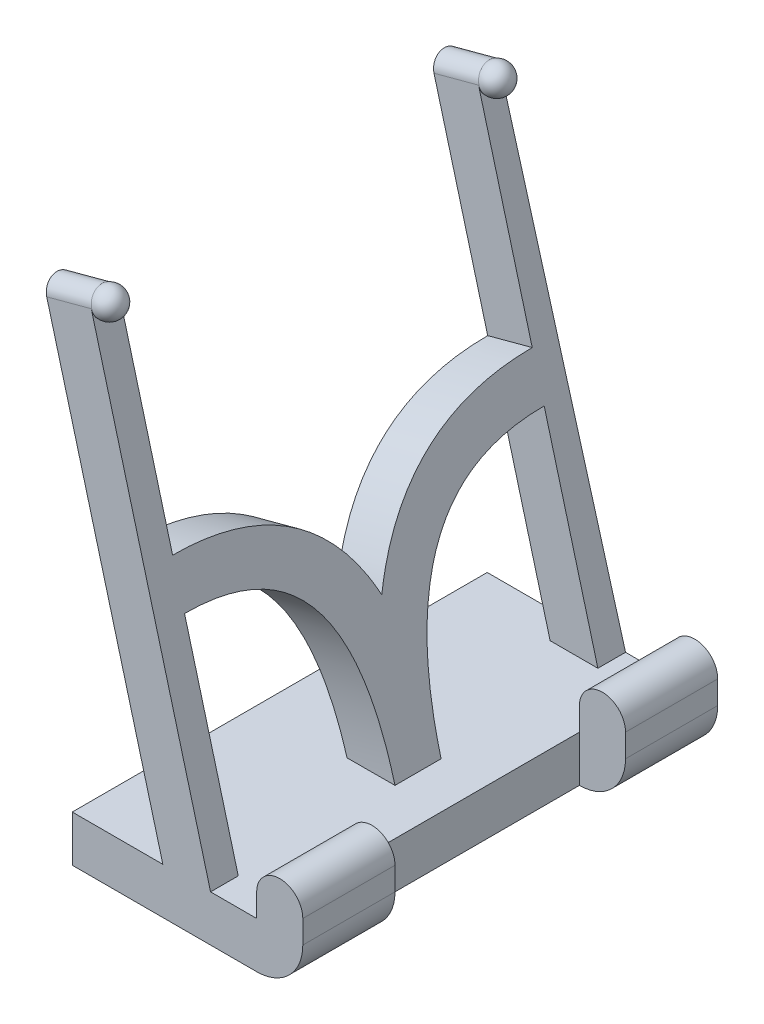
ISO-10303-21;
HEADER;
FILE_DESCRIPTION(('STEP AP214'),'2;1');
FILE_NAME('part.step','',(''),(''),'','','');
FILE_SCHEMA(('AUTOMOTIVE_DESIGN { 1 0 10303 214 1 1 1 1 }'));
ENDSEC;
DATA;
#1=APPLICATION_CONTEXT('core data for automotive mechanical design processes');
#2=APPLICATION_PROTOCOL_DEFINITION('international standard','automotive_design',2000,#1);
#3=PRODUCT_CONTEXT('',#1,'mechanical');
#4=PRODUCT('Part','Part','',(#3));
#5=PRODUCT_RELATED_PRODUCT_CATEGORY('part','',(#4));
#6=PRODUCT_DEFINITION_FORMATION('','',#4);
#7=PRODUCT_DEFINITION_CONTEXT('part definition',#1,'design');
#8=PRODUCT_DEFINITION('design','',#6,#7);
#9=PRODUCT_DEFINITION_SHAPE('','',#8);
#10=(LENGTH_UNIT() NAMED_UNIT(*) SI_UNIT(.MILLI.,.METRE.));
#11=(NAMED_UNIT(*) PLANE_ANGLE_UNIT() SI_UNIT($,.RADIAN.));
#12=(NAMED_UNIT(*) SI_UNIT($,.STERADIAN.) SOLID_ANGLE_UNIT());
#13=UNCERTAINTY_MEASURE_WITH_UNIT(LENGTH_MEASURE(1.E-05),#10,'distance_accuracy_value','');
#14=(GEOMETRIC_REPRESENTATION_CONTEXT(3) GLOBAL_UNCERTAINTY_ASSIGNED_CONTEXT((#13)) GLOBAL_UNIT_ASSIGNED_CONTEXT((#10,
#11,#12)) REPRESENTATION_CONTEXT('',''));
#15=CARTESIAN_POINT('',(0.,0.,0.));
#16=DIRECTION('',(0.,0.,1.));
#17=DIRECTION('',(1.,0.,0.));
#18=AXIS2_PLACEMENT_3D('',#15,#16,#17);
#19=CARTESIAN_POINT('',(-10.,10.,0.));
#20=DIRECTION('',(0.,0.,1.));
#21=DIRECTION('',(1.,0.,0.));
#22=AXIS2_PLACEMENT_3D('',#19,#20,#21);
#23=CYLINDRICAL_SURFACE('',#22,10.);
#24=DIRECTION('',(0.,0.,-1.));
#25=VECTOR('',#24,1.);
#26=CARTESIAN_POINT('',(0.,10.,0.));
#27=LINE('',#26,#25);
#28=CARTESIAN_POINT('',(0.,10.,-25.));
#29=VERTEX_POINT('',#28);
#30=CARTESIAN_POINT('',(0.,10.,-45.));
#31=VERTEX_POINT('',#30);
#32=EDGE_CURVE('E744',#29,#31,#27,.T.);
#33=ORIENTED_EDGE('',*,*,#32,.F.);
#34=CARTESIAN_POINT('',(-10.,10.,-25.));
#35=DIRECTION('',(0.,0.,-1.));
#36=DIRECTION('',(-1.,0.,0.));
#37=AXIS2_PLACEMENT_3D('',#34,#35,#36);
#38=CIRCLE('',#37,10.);
#39=CARTESIAN_POINT('',(-10.,0.,-25.));
#40=VERTEX_POINT('',#39);
#41=EDGE_CURVE('E156',#40,#29,#38,.F.);
#42=ORIENTED_EDGE('',*,*,#41,.F.);
#43=DIRECTION('',(0.,0.,-1.));
#44=VECTOR('',#43,1.);
#45=CARTESIAN_POINT('',(-10.,0.,0.));
#46=LINE('',#45,#44);
#47=CARTESIAN_POINT('',(-10.,0.,-45.));
#48=VERTEX_POINT('',#47);
#49=EDGE_CURVE('E748',#48,#40,#46,.F.);
#50=ORIENTED_EDGE('',*,*,#49,.F.);
#51=CARTESIAN_POINT('',(-10.,10.,-45.));
#52=DIRECTION('',(0.,0.,-1.));
#53=DIRECTION('',(-1.,0.,0.));
#54=AXIS2_PLACEMENT_3D('',#51,#52,#53);
#55=CIRCLE('',#54,10.);
#56=EDGE_CURVE('E12',#31,#48,#55,.T.);
#57=ORIENTED_EDGE('',*,*,#56,.F.);
#58=EDGE_LOOP('',(#33,#42,#50,#57));
#59=FACE_BOUND('',#58,.T.);
#60=ADVANCED_FACE('F148',(#59),#23,.T.);
#61=CARTESIAN_POINT('',(-10.,10.,0.));
#62=DIRECTION('',(0.,0.,1.));
#63=DIRECTION('',(1.,0.,0.));
#64=AXIS2_PLACEMENT_3D('',#61,#62,#63);
#65=CYLINDRICAL_SURFACE('',#64,10.);
#66=DIRECTION('',(0.,0.,-1.));
#67=VECTOR('',#66,1.);
#68=CARTESIAN_POINT('',(0.,10.,0.));
#69=LINE('',#68,#67);
#70=CARTESIAN_POINT('',(0.,10.,45.));
#71=VERTEX_POINT('',#70);
#72=CARTESIAN_POINT('',(0.,10.,25.));
#73=VERTEX_POINT('',#72);
#74=EDGE_CURVE('E730',#71,#73,#69,.T.);
#75=ORIENTED_EDGE('',*,*,#74,.F.);
#76=CARTESIAN_POINT('',(-9.99999999999999,10.,45.));
#77=DIRECTION('',(0.,0.,-1.));
#78=DIRECTION('',(-1.,0.,0.));
#79=AXIS2_PLACEMENT_3D('',#76,#77,#78);
#80=CIRCLE('',#79,10.);
#81=CARTESIAN_POINT('',(-9.99999999999999,0.,45.));
#82=VERTEX_POINT('',#81);
#83=EDGE_CURVE('E738',#82,#71,#80,.F.);
#84=ORIENTED_EDGE('',*,*,#83,.F.);
#85=DIRECTION('',(0.,0.,-1.));
#86=VECTOR('',#85,1.);
#87=CARTESIAN_POINT('',(-10.,0.,0.));
#88=LINE('',#87,#86);
#89=CARTESIAN_POINT('',(-9.99999999999999,0.,25.));
#90=VERTEX_POINT('',#89);
#91=EDGE_CURVE('E734',#90,#82,#88,.F.);
#92=ORIENTED_EDGE('',*,*,#91,.F.);
#93=CARTESIAN_POINT('',(-9.99999999999999,10.,25.));
#94=DIRECTION('',(0.,0.,-1.));
#95=DIRECTION('',(-1.,0.,0.));
#96=AXIS2_PLACEMENT_3D('',#93,#94,#95);
#97=CIRCLE('',#96,10.);
#98=EDGE_CURVE('E741',#73,#90,#97,.T.);
#99=ORIENTED_EDGE('',*,*,#98,.F.);
#100=EDGE_LOOP('',(#75,#84,#92,#99));
#101=FACE_BOUND('',#100,.T.);
#102=ADVANCED_FACE('F815',(#101),#65,.T.);
#103=CARTESIAN_POINT('',(-4.99999999999999,15.,25.));
#104=DIRECTION('',(0.,0.,1.));
#105=DIRECTION('',(1.,0.,0.));
#106=AXIS2_PLACEMENT_3D('',#103,#104,#105);
#107=CYLINDRICAL_SURFACE('',#106,5.);
#108=DIRECTION('',(0.,0.,1.));
#109=VECTOR('',#108,1.);
#110=CARTESIAN_POINT('',(0.,15.,0.));
#111=LINE('',#110,#109);
#112=CARTESIAN_POINT('',(0.,15.,25.));
#113=VERTEX_POINT('',#112);
#114=CARTESIAN_POINT('',(0.,15.,45.));
#115=VERTEX_POINT('',#114);
#116=EDGE_CURVE('E716',#113,#115,#111,.T.);
#117=ORIENTED_EDGE('',*,*,#116,.F.);
#118=CARTESIAN_POINT('',(-4.99999999999999,15.,25.));
#119=DIRECTION('',(0.,0.,-1.));
#120=DIRECTION('',(-1.,0.,0.));
#121=AXIS2_PLACEMENT_3D('',#118,#119,#120);
#122=CIRCLE('',#121,5.);
#123=CARTESIAN_POINT('',(-9.99999999999999,15.,25.));
#124=VERTEX_POINT('',#123);
#125=EDGE_CURVE('E724',#124,#113,#122,.T.);
#126=ORIENTED_EDGE('',*,*,#125,.F.);
#127=DIRECTION('',(0.,0.,1.));
#128=VECTOR('',#127,1.);
#129=CARTESIAN_POINT('',(-9.99999999999998,15.,0.));
#130=LINE('',#129,#128);
#131=CARTESIAN_POINT('',(-9.99999999999999,15.,45.));
#132=VERTEX_POINT('',#131);
#133=EDGE_CURVE('E720',#132,#124,#130,.F.);
#134=ORIENTED_EDGE('',*,*,#133,.F.);
#135=CARTESIAN_POINT('',(-4.99999999999998,15.,45.));
#136=DIRECTION('',(0.,0.,-1.));
#137=DIRECTION('',(-1.,0.,0.));
#138=AXIS2_PLACEMENT_3D('',#135,#136,#137);
#139=CIRCLE('',#138,5.);
#140=EDGE_CURVE('E727',#115,#132,#139,.F.);
#141=ORIENTED_EDGE('',*,*,#140,.F.);
#142=EDGE_LOOP('',(#117,#126,#134,#141));
#143=FACE_BOUND('',#142,.T.);
#144=ADVANCED_FACE('F811',(#143),#107,.T.);
#145=CARTESIAN_POINT('',(-5.00000000000001,15.,-45.));
#146=DIRECTION('',(0.,0.,1.));
#147=DIRECTION('',(1.,0.,0.));
#148=AXIS2_PLACEMENT_3D('',#145,#146,#147);
#149=CYLINDRICAL_SURFACE('',#148,4.99999999999999);
#150=DIRECTION('',(0.,0.,1.));
#151=VECTOR('',#150,1.);
#152=CARTESIAN_POINT('',(0.,15.,0.));
#153=LINE('',#152,#151);
#154=CARTESIAN_POINT('',(0.,15.,-45.));
#155=VERTEX_POINT('',#154);
#156=CARTESIAN_POINT('',(0.,15.,-25.));
#157=VERTEX_POINT('',#156);
#158=EDGE_CURVE('E471',#155,#157,#153,.T.);
#159=ORIENTED_EDGE('',*,*,#158,.F.);
#160=CARTESIAN_POINT('',(-5.00000000000001,15.,-45.));
#161=DIRECTION('',(0.,0.,-1.));
#162=DIRECTION('',(-1.,0.,0.));
#163=AXIS2_PLACEMENT_3D('',#160,#161,#162);
#164=CIRCLE('',#163,4.99999999999999);
#165=CARTESIAN_POINT('',(-10.,15.,-45.));
#166=VERTEX_POINT('',#165);
#167=EDGE_CURVE('E710',#166,#155,#164,.T.);
#168=ORIENTED_EDGE('',*,*,#167,.F.);
#169=DIRECTION('',(0.,0.,-1.));
#170=VECTOR('',#169,1.);
#171=CARTESIAN_POINT('',(-10.,15.,-45.));
#172=LINE('',#171,#170);
#173=CARTESIAN_POINT('',(-10.,15.,-25.));
#174=VERTEX_POINT('',#173);
#175=EDGE_CURVE('E706',#174,#166,#172,.T.);
#176=ORIENTED_EDGE('',*,*,#175,.F.);
#177=CARTESIAN_POINT('',(-5.,15.,-25.));
#178=DIRECTION('',(0.,0.,-1.));
#179=DIRECTION('',(-1.,0.,0.));
#180=AXIS2_PLACEMENT_3D('',#177,#178,#179);
#181=CIRCLE('',#180,4.99999999999999);
#182=EDGE_CURVE('E713',#157,#174,#181,.F.);
#183=ORIENTED_EDGE('',*,*,#182,.F.);
#184=EDGE_LOOP('',(#159,#168,#176,#183));
#185=FACE_BOUND('',#184,.T.);
#186=ADVANCED_FACE('F830',(#185),#149,.T.);
#187=CARTESIAN_POINT('',(-16.1602540378444,-4.3301270189222,0.));
#188=DIRECTION('',(0.965925826289068,0.258819045102521,0.));
#189=DIRECTION('',(-0.258819045102521,0.965925826289068,0.));
#190=AXIS2_PLACEMENT_3D('',#187,#188,#189);
#191=PLANE('',#190);
#192=DIRECTION('',(-0.258802756041451,0.965865034685545,0.0112191014453307));
#193=VECTOR('',#192,1.);
#194=CARTESIAN_POINT('',(-20.,10.,-45.));
#195=LINE('',#194,#193);
#196=CARTESIAN_POINT('',(-20.,10.,-45.));
#197=VERTEX_POINT('',#196);
#198=CARTESIAN_POINT('',(-45.2818757778133,104.353244913444,-43.9040304924956));
#199=VERTEX_POINT('',#198);
#200=EDGE_CURVE('E362',#197,#199,#195,.T.);
#201=ORIENTED_EDGE('',*,*,#200,.T.);
#202=CARTESIAN_POINT('',(-45.8819045102522,106.592582628907,-42.));
#203=DIRECTION('',(0.965925826289068,0.258819045102521,0.));
#204=DIRECTION('',(0.258819045102521,-0.965925826289068,0.));
#205=AXIS2_PLACEMENT_3D('',#202,#203,#204);
#206=CIRCLE('',#205,2.99999999999999);
#207=CARTESIAN_POINT('',(-45.8819045102522,106.592582628907,-39.));
#208=VERTEX_POINT('',#207);
#209=EDGE_CURVE('E349',#208,#199,#206,.T.);
#210=ORIENTED_EDGE('',*,*,#209,.F.);
#211=DIRECTION('',(0.258819045102521,-0.965925826289068,0.));
#212=VECTOR('',#211,1.);
#213=CARTESIAN_POINT('',(-45.8819045102521,106.592582628907,-39.));
#214=LINE('',#213,#212);
#215=CARTESIAN_POINT('',(-34.2350474806651,63.1259204459973,-39.));
#216=VERTEX_POINT('',#215);
#217=EDGE_CURVE('E328',#208,#216,#214,.T.);
#218=ORIENTED_EDGE('',*,*,#217,.T.);
#219=CARTESIAN_POINT('',(-34.2350474806651,63.1259204459973,-39.0000000000422));
#220=CARTESIAN_POINT('',(-34.2350474806651,63.1259204459973,-36.3621794872216));
#221=CARTESIAN_POINT('',(-34.0699710107576,62.5098466731686,-28.8285622176386));
#222=CARTESIAN_POINT('',(-33.3834750253567,59.9478087764603,-19.8240986223686));
#223=CARTESIAN_POINT('',(-32.2062138604687,55.5542102953204,-12.0080244789486));
#224=CARTESIAN_POINT('',(-30.5541359254504,49.3885715037686,-5.61432407028928));
#225=CARTESIAN_POINT('',(-29.0056217342503,43.6094378659685,-1.99117612797194));
#226=CARTESIAN_POINT('',(-28.1641573713426,40.4690501108384,-0.465805969964786));
#227=CARTESIAN_POINT('',(-27.8699663570546,39.3711142983855,0.));
#228=B_SPLINE_CURVE_WITH_KNOTS('',2,(#219,#220,#221,#222,#223,#224,#225,#226,#227),
.UNSPECIFIED.,.F.,.F.,(3,1,1,1,1,1,1,3),(0.,0.0625,0.1875,0.3125,0.4375,0.5625,
0.624322405005959,0.655572405007374),.UNSPECIFIED.);
#229=CARTESIAN_POINT('',(-27.8699663570546,39.3711142983855,0.));
#230=VERTEX_POINT('',#229);
#231=EDGE_CURVE('E491',#216,#230,#228,.T.);
#232=ORIENTED_EDGE('',*,*,#231,.T.);
#233=CARTESIAN_POINT('',(-34.2350474806387,63.1259204458988,39.));
#234=CARTESIAN_POINT('',(-34.2409306686707,63.1478768025447,31.0804509510836));
#235=CARTESIAN_POINT('',(-33.3834677876129,59.9477817648328,19.8243597805112));
#236=CARTESIAN_POINT('',(-32.2060677968119,55.5536651783323,12.0086745404674));
#237=CARTESIAN_POINT('',(-30.5540980348329,49.388430094059,5.61475525686646));
#238=CARTESIAN_POINT('',(-28.4813328365245,41.6527650618116,0.769136884060179));
#239=CARTESIAN_POINT('',(-26.0323778235426,32.5131405279126,-2.57499998783517));
#240=CARTESIAN_POINT('',(-22.5194312559526,19.4026454533919,-5.00833183711217));
#241=CARTESIAN_POINT('',(-19.9999736842516,9.99990178829003,-4.99817568059745));
#242=B_SPLINE_CURVE_WITH_KNOTS('',2,(#233,#234,#235,#236,#237,#238,#239,#240,#241),
.UNSPECIFIED.,.F.,.F.,(3,1,1,1,1,1,1,3),(0.,0.1875,0.3125,0.4375,0.5625,0.6875,0.8125,1.),.UNSPECIFIED.);
#243=CARTESIAN_POINT('',(-34.2350474806387,63.1259204458987,39.));
#244=VERTEX_POINT('',#243);
#245=EDGE_CURVE('E499',#244,#230,#242,.T.);
#246=ORIENTED_EDGE('',*,*,#245,.F.);
#247=DIRECTION('',(0.258819045102521,-0.965925826289068,0.));
#248=VECTOR('',#247,1.);
#249=CARTESIAN_POINT('',(-45.8819045102521,106.592582628907,39.));
#250=LINE('',#249,#248);
#251=CARTESIAN_POINT('',(-45.8819045102521,106.592582628907,39.));
#252=VERTEX_POINT('',#251);
#253=EDGE_CURVE('E563',#252,#244,#250,.T.);
#254=ORIENTED_EDGE('',*,*,#253,.F.);
#255=CARTESIAN_POINT('',(-45.8819045102521,106.592582628907,42.));
#256=DIRECTION('',(0.965925826289068,0.258819045102521,0.));
#257=DIRECTION('',(-0.258819045102521,0.965925826289068,0.));
#258=AXIS2_PLACEMENT_3D('',#255,#256,#257);
#259=CIRCLE('',#258,2.99999999999999);
#260=CARTESIAN_POINT('',(-45.8819045102521,106.592582628907,45.));
#261=VERTEX_POINT('',#260);
#262=EDGE_CURVE('E373',#261,#252,#259,.T.);
#263=ORIENTED_EDGE('',*,*,#262,.F.);
#264=DIRECTION('',(-0.258819045102521,0.965925826289068,0.));
#265=VECTOR('',#264,1.);
#266=CARTESIAN_POINT('',(-20.,10.,45.));
#267=LINE('',#266,#265);
#268=CARTESIAN_POINT('',(-20.,10.,45.));
#269=VERTEX_POINT('',#268);
#270=EDGE_CURVE('E567',#269,#261,#267,.T.);
#271=ORIENTED_EDGE('',*,*,#270,.F.);
#272=DIRECTION('',(0.,0.,-1.));
#273=VECTOR('',#272,1.);
#274=CARTESIAN_POINT('',(-20.,10.,45.));
#275=LINE('',#274,#273);
#276=CARTESIAN_POINT('',(-20.,10.,39.));
#277=VERTEX_POINT('',#276);
#278=EDGE_CURVE('E355',#269,#277,#275,.T.);
#279=ORIENTED_EDGE('',*,*,#278,.T.);
#280=CARTESIAN_POINT('',(-31.6468570296135,53.4666621830081,39.));
#281=VERTEX_POINT('',#280);
#282=EDGE_CURVE('E562',#281,#277,#250,.T.);
#283=ORIENTED_EDGE('',*,*,#282,.F.);
#284=CARTESIAN_POINT('',(-31.6468570296135,53.4666621830081,39.));
#285=CARTESIAN_POINT('',(-31.6409304469576,53.4445438754211,32.2946677797803));
#286=CARTESIAN_POINT('',(-30.981826841697,50.9847357331368,23.7463108813194));
#287=CARTESIAN_POINT('',(-30.1371780276481,47.8324634445537,18.1559598815341));
#288=CARTESIAN_POINT('',(-28.9583043869896,43.4328471219125,13.5813602634637));
#289=CARTESIAN_POINT('',(-27.3914314673449,37.5851977767947,9.8959707783955));
#290=CARTESIAN_POINT('',(-25.3919527196001,30.1230415015568,7.14660789976751));
#291=CARTESIAN_POINT('',(-22.3333615436308,18.7082238332574,5.00995064322105));
#292=CARTESIAN_POINT('',(-20.,10.,5.00000000000001));
#293=B_SPLINE_CURVE_WITH_KNOTS('',2,(#284,#285,#286,#287,#288,#289,#290,#291,#292),
.UNSPECIFIED.,.F.,.F.,(3,1,1,1,1,1,1,3),(0.,0.1875,0.3125,0.4375,0.5625,0.6875,0.8125,1.),.UNSPECIFIED.);
#294=CARTESIAN_POINT('',(-20.,10.,5.00000000000002));
#295=VERTEX_POINT('',#294);
#296=EDGE_CURVE('E509',#281,#295,#293,.T.);
#297=ORIENTED_EDGE('',*,*,#296,.T.);
#298=DIRECTION('',(0.,0.,-1.));
#299=VECTOR('',#298,1.);
#300=CARTESIAN_POINT('',(-20.,10.,0.));
#301=LINE('',#300,#299);
#302=CARTESIAN_POINT('',(-20.,10.,-5.00000000000001));
#303=VERTEX_POINT('',#302);
#304=EDGE_CURVE('E518',#295,#303,#301,.T.);
#305=ORIENTED_EDGE('',*,*,#304,.T.);
#306=CARTESIAN_POINT('',(-31.6468570296135,53.4666621830081,-39.));
#307=CARTESIAN_POINT('',(-31.6409304469576,53.4445438754212,-32.2946677797803));
#308=CARTESIAN_POINT('',(-30.981826841697,50.9847357331368,-23.7463108813194));
#309=CARTESIAN_POINT('',(-30.1371780276482,47.8324634445537,-18.1559598815341));
#310=CARTESIAN_POINT('',(-28.9583043869897,43.4328471219125,-13.5813602634637));
#311=CARTESIAN_POINT('',(-27.391431467345,37.5851977767947,-9.8959707783955));
#312=CARTESIAN_POINT('',(-25.3919527196001,30.1230415015568,-7.14660789976751));
#313=CARTESIAN_POINT('',(-22.3333615436308,18.7082238332574,-5.00995064322104));
#314=CARTESIAN_POINT('',(-20.,10.,-5.));
#315=B_SPLINE_CURVE_WITH_KNOTS('',2,(#306,#307,#308,#309,#310,#311,#312,#313,#314),
.UNSPECIFIED.,.F.,.F.,(3,1,1,1,1,1,1,3),(0.,0.1875,0.3125,0.4375,0.5625,0.6875,0.8125,1.),.UNSPECIFIED.);
#316=CARTESIAN_POINT('',(-31.6468570296135,53.4666621830081,-39.));
#317=VERTEX_POINT('',#316);
#318=EDGE_CURVE('E385',#317,#303,#315,.T.);
#319=ORIENTED_EDGE('',*,*,#318,.F.);
#320=CARTESIAN_POINT('',(-20.,10.,-39.));
#321=VERTEX_POINT('',#320);
#322=EDGE_CURVE('E341',#317,#321,#214,.T.);
#323=ORIENTED_EDGE('',*,*,#322,.T.);
#324=DIRECTION('',(0.,0.,1.));
#325=VECTOR('',#324,1.);
#326=CARTESIAN_POINT('',(-20.,10.,-45.));
#327=LINE('',#326,#325);
#328=EDGE_CURVE('E340',#197,#321,#327,.T.);
#329=ORIENTED_EDGE('',*,*,#328,.F.);
#330=EDGE_LOOP('',(#201,#210,#218,#232,#246,#254,#263,#271,#279,#283,#297,#305,#319,#323,#329));
#331=FACE_BOUND('',#330,.T.);
#332=ADVANCED_FACE('F359',(#331),#191,.T.);
#333=CARTESIAN_POINT('',(0.,10.,0.));
#334=DIRECTION('',(0.,1.,0.));
#335=DIRECTION('',(0.,0.,1.));
#336=AXIS2_PLACEMENT_3D('',#333,#334,#335);
#337=PLANE('',#336);
#338=DIRECTION('',(1.,0.,0.));
#339=VECTOR('',#338,1.);
#340=CARTESIAN_POINT('',(0.,10.,45.));
#341=LINE('',#340,#339);
#342=CARTESIAN_POINT('',(-50.,10.,45.));
#343=VERTEX_POINT('',#342);
#344=CARTESIAN_POINT('',(-30.3527618041008,10.,45.));
#345=VERTEX_POINT('',#344);
#346=EDGE_CURVE('E636',#343,#345,#341,.T.);
#347=ORIENTED_EDGE('',*,*,#346,.T.);
#348=DIRECTION('',(0.,0.,-1.));
#349=VECTOR('',#348,1.);
#350=CARTESIAN_POINT('',(-30.3527618041008,10.,0.));
#351=LINE('',#350,#349);
#352=CARTESIAN_POINT('',(-30.3527618041008,10.,39.));
#353=VERTEX_POINT('',#352);
#354=EDGE_CURVE('E672',#345,#353,#351,.T.);
#355=ORIENTED_EDGE('',*,*,#354,.T.);
#356=DIRECTION('',(1.,0.,0.));
#357=VECTOR('',#356,1.);
#358=CARTESIAN_POINT('',(0.,10.,39.));
#359=LINE('',#358,#357);
#360=EDGE_CURVE('E670',#353,#277,#359,.T.);
#361=ORIENTED_EDGE('',*,*,#360,.T.);
#362=ORIENTED_EDGE('',*,*,#278,.F.);
#363=CARTESIAN_POINT('',(-9.99999999999999,10.,45.));
#364=VERTEX_POINT('',#363);
#365=EDGE_CURVE('E635',#269,#364,#341,.T.);
#366=ORIENTED_EDGE('',*,*,#365,.T.);
#367=DIRECTION('',(0.,0.,1.));
#368=VECTOR('',#367,1.);
#369=CARTESIAN_POINT('',(-9.99999999999999,10.,0.));
#370=LINE('',#369,#368);
#371=CARTESIAN_POINT('',(-9.99999999999999,10.,25.));
#372=VERTEX_POINT('',#371);
#373=EDGE_CURVE('E627',#372,#364,#370,.T.);
#374=ORIENTED_EDGE('',*,*,#373,.F.);
#375=CARTESIAN_POINT('',(-10.,10.,-25.));
#376=VERTEX_POINT('',#375);
#377=EDGE_CURVE('E626',#376,#372,#370,.T.);
#378=ORIENTED_EDGE('',*,*,#377,.F.);
#379=CARTESIAN_POINT('',(-10.,10.,-45.));
#380=VERTEX_POINT('',#379);
#381=EDGE_CURVE('E621',#380,#376,#370,.T.);
#382=ORIENTED_EDGE('',*,*,#381,.F.);
#383=DIRECTION('',(1.,0.,0.));
#384=VECTOR('',#383,1.);
#385=CARTESIAN_POINT('',(0.,10.,-45.));
#386=LINE('',#385,#384);
#387=EDGE_CURVE('E625',#197,#380,#386,.T.);
#388=ORIENTED_EDGE('',*,*,#387,.F.);
#389=ORIENTED_EDGE('',*,*,#328,.T.);
#390=DIRECTION('',(1.,0.,0.));
#391=VECTOR('',#390,1.);
#392=CARTESIAN_POINT('',(0.,10.,-39.));
#393=LINE('',#392,#391);
#394=CARTESIAN_POINT('',(-30.3527618041008,10.,-39.));
#395=VERTEX_POINT('',#394);
#396=EDGE_CURVE('E660',#395,#321,#393,.T.);
#397=ORIENTED_EDGE('',*,*,#396,.F.);
#398=CARTESIAN_POINT('',(-30.3527618041008,10.,-44.9699366162071));
#399=VERTEX_POINT('',#398);
#400=EDGE_CURVE('E668',#395,#399,#351,.T.);
#401=ORIENTED_EDGE('',*,*,#400,.T.);
#402=DIRECTION('',(-0.9999957837094,0.,0.0029038876394341));
#403=VECTOR('',#402,1.);
#404=CARTESIAN_POINT('',(-0.130843044079447,10.,-45.057698042562));
#405=LINE('',#404,#403);
#406=EDGE_CURVE('E664',#197,#399,#405,.T.);
#407=ORIENTED_EDGE('',*,*,#406,.F.);
#408=CARTESIAN_POINT('',(-50.,10.,-45.));
#409=VERTEX_POINT('',#408);
#410=EDGE_CURVE('E628',#409,#197,#386,.T.);
#411=ORIENTED_EDGE('',*,*,#410,.F.);
#412=DIRECTION('',(0.,0.,1.));
#413=VECTOR('',#412,1.);
#414=CARTESIAN_POINT('',(-50.,10.,0.));
#415=LINE('',#414,#413);
#416=EDGE_CURVE('E632',#409,#343,#415,.T.);
#417=ORIENTED_EDGE('',*,*,#416,.T.);
#418=EDGE_LOOP('',(#347,#355,#361,#362,#366,#374,#378,#382,#388,#389,#397,#401,#407,#411,#417));
#419=FACE_BOUND('',#418,.T.);
#420=CARTESIAN_POINT('',(-30.3527618015758,9.99999999057659,5.03202578206773));
#421=VERTEX_POINT('',#420);
#422=CARTESIAN_POINT('',(-30.3527618041008,10.,-5.03202578206772));
#423=VERTEX_POINT('',#422);
#424=EDGE_CURVE('E671',#421,#423,#351,.T.);
#425=ORIENTED_EDGE('',*,*,#424,.T.);
#426=CARTESIAN_POINT('',(-30.3527618014867,9.99999999512204,-5.03202578205974));
#427=CARTESIAN_POINT('',(-29.7776142807964,9.99999999824819,-5.02857793150669));
#428=CARTESIAN_POINT('',(-29.2024650476381,9.99999999953059,-5.0254174381502));
#429=CARTESIAN_POINT('',(-28.0521648064389,10.0000000004694,-5.0196617870845));
#430=CARTESIAN_POINT('',(-27.4770137984031,10.0000000001258,-5.01706662833795));
#431=CARTESIAN_POINT('',(-26.3267100556372,9.99999999987418,-5.0124322572121));
#432=CARTESIAN_POINT('',(-25.7515573209092,9.99999999996612,-5.01039304434098));
#433=CARTESIAN_POINT('',(-24.6012501974276,10.0000000000339,-5.00686150384055));
#434=CARTESIAN_POINT('',(-24.0260958086741,10.0000000000097,-5.00536917618964));
#435=CARTESIAN_POINT('',(-22.8757853590972,9.99999999999032,-5.00292255426023));
#436=CARTESIAN_POINT('',(-22.3006292982727,9.99999999999515,-5.00196826047897));
#437=CARTESIAN_POINT('',(-21.1503155135824,10.0000000000048,-5.00058915500404));
#438=CARTESIAN_POINT('',(-20.5751577897154,10.0000000000097,-5.00016434425576));
#439=CARTESIAN_POINT('',(-20.,10.0000000000001,-5.));
#440=B_SPLINE_CURVE_WITH_KNOTS('',3,(#426,#427,#428,#429,#430,#431,#432,#433,#434,#435,#436,
#437,#438,#439),.UNSPECIFIED.,.F.,.F.,(4,2,2,2,2,2,4),(0.,1.72547347848302,3.45094379088753,
5.17641257681726,6.9018812945504,8.62735160695111,10.3528250001564),.UNSPECIFIED.);
#441=EDGE_CURVE('E462',#423,#303,#440,.T.);
#442=ORIENTED_EDGE('',*,*,#441,.T.);
#443=ORIENTED_EDGE('',*,*,#304,.F.);
#444=CARTESIAN_POINT('',(-30.3527618014867,9.99999999512204,5.03202578205975));
#445=CARTESIAN_POINT('',(-29.7776142807964,9.99999999824819,5.02857793150669));
#446=CARTESIAN_POINT('',(-29.2024650476381,9.99999999953059,5.02541743815021));
#447=CARTESIAN_POINT('',(-28.0521648064388,10.0000000004694,5.01966178708451));
#448=CARTESIAN_POINT('',(-27.477013798403,10.0000000001258,5.01706662833796));
#449=CARTESIAN_POINT('',(-26.3267100556372,9.99999999987418,5.01243225721211));
#450=CARTESIAN_POINT('',(-25.7515573209092,9.99999999996613,5.01039304434098));
#451=CARTESIAN_POINT('',(-24.6012501974276,10.0000000000339,5.00686150384055));
#452=CARTESIAN_POINT('',(-24.0260958086741,10.0000000000097,5.00536917618964));
#453=CARTESIAN_POINT('',(-22.8757853590972,9.99999999999032,5.00292255426023));
#454=CARTESIAN_POINT('',(-22.3006292982727,9.99999999999516,5.00196826047897));
#455=CARTESIAN_POINT('',(-21.1503155135824,10.0000000000048,5.00058915500404));
#456=CARTESIAN_POINT('',(-20.5751577897154,10.0000000000097,5.00016434425576));
#457=CARTESIAN_POINT('',(-20.,10.,5.00000000000001));
#458=B_SPLINE_CURVE_WITH_KNOTS('',3,(#444,#445,#446,#447,#448,#449,#450,#451,#452,#453,#454,
#455,#456,#457),.UNSPECIFIED.,.F.,.F.,(4,2,2,2,2,2,4),(0.,1.72547347848302,3.45094379088754,
5.17641257681727,6.90188129455041,8.62735160695112,10.3528250001564),.UNSPECIFIED.);
#459=EDGE_CURVE('E455',#421,#295,#458,.T.);
#460=ORIENTED_EDGE('',*,*,#459,.F.);
#461=EDGE_LOOP('',(#425,#442,#443,#460));
#462=FACE_BOUND('',#461,.T.);
#463=ADVANCED_FACE('F446',(#419,#462),#337,.T.);
#464=CARTESIAN_POINT('',(-9.99999999999999,10.,0.));
#465=DIRECTION('',(1.,0.,0.));
#466=DIRECTION('',(0.,0.,-1.));
#467=AXIS2_PLACEMENT_3D('',#464,#465,#466);
#468=PLANE('',#467);
#469=DIRECTION('',(0.,0.,1.));
#470=VECTOR('',#469,1.);
#471=CARTESIAN_POINT('',(-9.99999999999999,0.,0.));
#472=LINE('',#471,#470);
#473=EDGE_CURVE('E620',#40,#90,#472,.T.);
#474=ORIENTED_EDGE('',*,*,#473,.F.);
#475=DIRECTION('',(0.,-1.,0.));
#476=VECTOR('',#475,1.);
#477=CARTESIAN_POINT('',(-10.,20.,-25.));
#478=LINE('',#477,#476);
#479=EDGE_CURVE('E601',#376,#40,#478,.T.);
#480=ORIENTED_EDGE('',*,*,#479,.F.);
#481=ORIENTED_EDGE('',*,*,#377,.T.);
#482=DIRECTION('',(0.,-1.,0.));
#483=VECTOR('',#482,1.);
#484=CARTESIAN_POINT('',(-9.99999999999999,20.,25.));
#485=LINE('',#484,#483);
#486=EDGE_CURVE('E609',#372,#90,#485,.T.);
#487=ORIENTED_EDGE('',*,*,#486,.T.);
#488=EDGE_LOOP('',(#474,#480,#481,#487));
#489=FACE_BOUND('',#488,.T.);
#490=ADVANCED_FACE('F450',(#489),#468,.T.);
#491=CARTESIAN_POINT('',(0.,10.,-45.));
#492=DIRECTION('',(0.,0.,-1.));
#493=DIRECTION('',(-1.,0.,0.));
#494=AXIS2_PLACEMENT_3D('',#491,#492,#493);
#495=PLANE('',#494);
#496=DIRECTION('',(0.,-1.,0.));
#497=VECTOR('',#496,1.);
#498=CARTESIAN_POINT('',(0.,20.,-45.));
#499=LINE('',#498,#497);
#500=EDGE_CURVE('E594',#155,#31,#499,.T.);
#501=ORIENTED_EDGE('',*,*,#500,.T.);
#502=ORIENTED_EDGE('',*,*,#56,.T.);
#503=DIRECTION('',(1.,0.,0.));
#504=VECTOR('',#503,1.);
#505=CARTESIAN_POINT('',(0.,0.,-45.));
#506=LINE('',#505,#504);
#507=CARTESIAN_POINT('',(-50.,0.,-45.));
#508=VERTEX_POINT('',#507);
#509=EDGE_CURVE('E643',#508,#48,#506,.T.);
#510=ORIENTED_EDGE('',*,*,#509,.F.);
#511=DIRECTION('',(0.,-1.,0.));
#512=VECTOR('',#511,1.);
#513=CARTESIAN_POINT('',(-50.,10.,-45.));
#514=LINE('',#513,#512);
#515=EDGE_CURVE('E657',#409,#508,#514,.T.);
#516=ORIENTED_EDGE('',*,*,#515,.F.);
#517=ORIENTED_EDGE('',*,*,#410,.T.);
#518=ORIENTED_EDGE('',*,*,#387,.T.);
#519=DIRECTION('',(0.,-1.,0.));
#520=VECTOR('',#519,1.);
#521=CARTESIAN_POINT('',(-10.,20.,-45.));
#522=LINE('',#521,#520);
#523=EDGE_CURVE('E535',#166,#380,#522,.T.);
#524=ORIENTED_EDGE('',*,*,#523,.F.);
#525=ORIENTED_EDGE('',*,*,#167,.T.);
#526=EDGE_LOOP('',(#501,#502,#510,#516,#517,#518,#524,#525));
#527=FACE_BOUND('',#526,.T.);
#528=ADVANCED_FACE('F823',(#527),#495,.T.);
#529=CARTESIAN_POINT('',(-50.,10.,0.));
#530=DIRECTION('',(1.,0.,0.));
#531=DIRECTION('',(0.,0.,-1.));
#532=AXIS2_PLACEMENT_3D('',#529,#530,#531);
#533=PLANE('',#532);
#534=DIRECTION('',(0.,0.,1.));
#535=VECTOR('',#534,1.);
#536=CARTESIAN_POINT('',(-50.,0.,0.));
#537=LINE('',#536,#535);
#538=CARTESIAN_POINT('',(-50.,0.,45.));
#539=VERTEX_POINT('',#538);
#540=EDGE_CURVE('E647',#508,#539,#537,.T.);
#541=ORIENTED_EDGE('',*,*,#540,.T.);
#542=DIRECTION('',(0.,-1.,0.));
#543=VECTOR('',#542,1.);
#544=CARTESIAN_POINT('',(-50.,10.,45.));
#545=LINE('',#544,#543);
#546=EDGE_CURVE('E639',#343,#539,#545,.T.);
#547=ORIENTED_EDGE('',*,*,#546,.F.);
#548=ORIENTED_EDGE('',*,*,#416,.F.);
#549=ORIENTED_EDGE('',*,*,#515,.T.);
#550=EDGE_LOOP('',(#541,#547,#548,#549));
#551=FACE_BOUND('',#550,.T.);
#552=ADVANCED_FACE('F822',(#551),#533,.F.);
#553=CARTESIAN_POINT('',(0.,10.,45.));
#554=DIRECTION('',(0.,0.,-1.));
#555=DIRECTION('',(-1.,0.,0.));
#556=AXIS2_PLACEMENT_3D('',#553,#554,#555);
#557=PLANE('',#556);
#558=DIRECTION('',(1.,0.,0.));
#559=VECTOR('',#558,1.);
#560=CARTESIAN_POINT('',(0.,0.,45.));
#561=LINE('',#560,#559);
#562=EDGE_CURVE('E650',#539,#82,#561,.T.);
#563=ORIENTED_EDGE('',*,*,#562,.T.);
#564=ORIENTED_EDGE('',*,*,#83,.T.);
#565=DIRECTION('',(0.,-1.,0.));
#566=VECTOR('',#565,1.);
#567=CARTESIAN_POINT('',(0.,20.,45.));
#568=LINE('',#567,#566);
#569=EDGE_CURVE('E613',#115,#71,#568,.T.);
#570=ORIENTED_EDGE('',*,*,#569,.F.);
#571=ORIENTED_EDGE('',*,*,#140,.T.);
#572=DIRECTION('',(0.,-1.,0.));
#573=VECTOR('',#572,1.);
#574=CARTESIAN_POINT('',(-9.99999999999999,20.,45.));
#575=LINE('',#574,#573);
#576=EDGE_CURVE('E617',#132,#364,#575,.T.);
#577=ORIENTED_EDGE('',*,*,#576,.T.);
#578=ORIENTED_EDGE('',*,*,#365,.F.);
#579=ORIENTED_EDGE('',*,*,#270,.T.);
#580=DIRECTION('',(0.965925826289068,0.258819045102521,0.));
#581=VECTOR('',#580,1.);
#582=CARTESIAN_POINT('',(-55.5411627731428,104.004392177882,45.));
#583=LINE('',#582,#581);
#584=CARTESIAN_POINT('',(-55.5411627731428,104.004392177882,45.));
#585=VERTEX_POINT('',#584);
#586=EDGE_CURVE('E500',#585,#261,#583,.T.);
#587=ORIENTED_EDGE('',*,*,#586,.F.);
#588=DIRECTION('',(-0.258819045102521,0.965925826289068,0.));
#589=VECTOR('',#588,1.);
#590=CARTESIAN_POINT('',(-29.6592582628907,7.41180954897478,45.));
#591=LINE('',#590,#589);
#592=EDGE_CURVE('E555',#345,#585,#591,.T.);
#593=ORIENTED_EDGE('',*,*,#592,.F.);
#594=ORIENTED_EDGE('',*,*,#346,.F.);
#595=ORIENTED_EDGE('',*,*,#546,.T.);
#596=EDGE_LOOP('',(#563,#564,#570,#571,#577,#578,#579,#587,#593,#594,#595));
#597=FACE_BOUND('',#596,.T.);
#598=ADVANCED_FACE('F804',(#597),#557,.F.);
#599=CARTESIAN_POINT('',(0.,0.,0.));
#600=DIRECTION('',(0.,1.,0.));
#601=DIRECTION('',(0.,0.,1.));
#602=AXIS2_PLACEMENT_3D('',#599,#600,#601);
#603=PLANE('',#602);
#604=ORIENTED_EDGE('',*,*,#509,.T.);
#605=ORIENTED_EDGE('',*,*,#49,.T.);
#606=ORIENTED_EDGE('',*,*,#473,.T.);
#607=ORIENTED_EDGE('',*,*,#91,.T.);
#608=ORIENTED_EDGE('',*,*,#562,.F.);
#609=ORIENTED_EDGE('',*,*,#540,.F.);
#610=EDGE_LOOP('',(#604,#605,#606,#607,#608,#609));
#611=FACE_BOUND('',#610,.T.);
#612=ADVANCED_FACE('F444',(#611),#603,.F.);
#613=CARTESIAN_POINT('',(-9.99999999999998,20.,0.));
#614=DIRECTION('',(-1.,0.,0.));
#615=DIRECTION('',(0.,0.,1.));
#616=AXIS2_PLACEMENT_3D('',#613,#614,#615);
#617=PLANE('',#616);
#618=ORIENTED_EDGE('',*,*,#576,.F.);
#619=ORIENTED_EDGE('',*,*,#133,.T.);
#620=EDGE_CURVE('E605',#124,#372,#485,.T.);
#621=ORIENTED_EDGE('',*,*,#620,.T.);
#622=ORIENTED_EDGE('',*,*,#373,.T.);
#623=EDGE_LOOP('',(#618,#619,#621,#622));
#624=FACE_BOUND('',#623,.T.);
#625=ADVANCED_FACE('F440',(#624),#617,.T.);
#626=CARTESIAN_POINT('',(0.,20.,0.));
#627=DIRECTION('',(1.,0.,0.));
#628=DIRECTION('',(0.,0.,-1.));
#629=AXIS2_PLACEMENT_3D('',#626,#627,#628);
#630=PLANE('',#629);
#631=ORIENTED_EDGE('',*,*,#569,.T.);
#632=ORIENTED_EDGE('',*,*,#74,.T.);
#633=DIRECTION('',(0.,-1.,0.));
#634=VECTOR('',#633,1.);
#635=CARTESIAN_POINT('',(0.,20.,25.));
#636=LINE('',#635,#634);
#637=EDGE_CURVE('E608',#113,#73,#636,.T.);
#638=ORIENTED_EDGE('',*,*,#637,.F.);
#639=ORIENTED_EDGE('',*,*,#116,.T.);
#640=EDGE_LOOP('',(#631,#632,#638,#639));
#641=FACE_BOUND('',#640,.T.);
#642=ADVANCED_FACE('F436',(#641),#630,.T.);
#643=CARTESIAN_POINT('',(0.,20.,25.));
#644=DIRECTION('',(0.,0.,-1.));
#645=DIRECTION('',(-1.,0.,0.));
#646=AXIS2_PLACEMENT_3D('',#643,#644,#645);
#647=PLANE('',#646);
#648=ORIENTED_EDGE('',*,*,#637,.T.);
#649=ORIENTED_EDGE('',*,*,#98,.T.);
#650=ORIENTED_EDGE('',*,*,#486,.F.);
#651=ORIENTED_EDGE('',*,*,#620,.F.);
#652=ORIENTED_EDGE('',*,*,#125,.T.);
#653=EDGE_LOOP('',(#648,#649,#650,#651,#652));
#654=FACE_BOUND('',#653,.T.);
#655=ADVANCED_FACE('F432',(#654),#647,.T.);
#656=CARTESIAN_POINT('',(-10.,20.,0.));
#657=DIRECTION('',(1.,0.,0.));
#658=DIRECTION('',(0.,0.,-1.));
#659=AXIS2_PLACEMENT_3D('',#656,#657,#658);
#660=PLANE('',#659);
#661=EDGE_CURVE('E602',#174,#376,#478,.T.);
#662=ORIENTED_EDGE('',*,*,#661,.F.);
#663=ORIENTED_EDGE('',*,*,#175,.T.);
#664=ORIENTED_EDGE('',*,*,#523,.T.);
#665=ORIENTED_EDGE('',*,*,#381,.T.);
#666=EDGE_LOOP('',(#662,#663,#664,#665));
#667=FACE_BOUND('',#666,.T.);
#668=ADVANCED_FACE('F429',(#667),#660,.F.);
#669=CARTESIAN_POINT('',(0.,20.,-25.));
#670=DIRECTION('',(0.,0.,-1.));
#671=DIRECTION('',(-1.,0.,0.));
#672=AXIS2_PLACEMENT_3D('',#669,#670,#671);
#673=PLANE('',#672);
#674=ORIENTED_EDGE('',*,*,#479,.T.);
#675=ORIENTED_EDGE('',*,*,#41,.T.);
#676=DIRECTION('',(0.,-1.,0.));
#677=VECTOR('',#676,1.);
#678=CARTESIAN_POINT('',(0.,20.,-25.));
#679=LINE('',#678,#677);
#680=EDGE_CURVE('E597',#157,#29,#679,.T.);
#681=ORIENTED_EDGE('',*,*,#680,.F.);
#682=ORIENTED_EDGE('',*,*,#182,.T.);
#683=ORIENTED_EDGE('',*,*,#661,.T.);
#684=EDGE_LOOP('',(#674,#675,#681,#682,#683));
#685=FACE_BOUND('',#684,.T.);
#686=ADVANCED_FACE('F425',(#685),#673,.F.);
#687=CARTESIAN_POINT('',(0.,20.,0.));
#688=DIRECTION('',(1.,0.,0.));
#689=DIRECTION('',(0.,0.,-1.));
#690=AXIS2_PLACEMENT_3D('',#687,#688,#689);
#691=PLANE('',#690);
#692=ORIENTED_EDGE('',*,*,#680,.T.);
#693=ORIENTED_EDGE('',*,*,#32,.T.);
#694=ORIENTED_EDGE('',*,*,#500,.F.);
#695=ORIENTED_EDGE('',*,*,#158,.T.);
#696=EDGE_LOOP('',(#692,#693,#694,#695));
#697=FACE_BOUND('',#696,.T.);
#698=ADVANCED_FACE('F421',(#697),#691,.T.);
#699=CARTESIAN_POINT('',(-41.3061152925042,50.8784717319829,-39.));
#700=CARTESIAN_POINT('',(-41.3001887098483,50.856353424396,-32.2946677797803));
#701=CARTESIAN_POINT('',(-40.6410851045877,48.3965452821116,-23.7463108813194));
#702=CARTESIAN_POINT('',(-39.7964362905389,45.2442729935285,-18.1559598815341));
#703=CARTESIAN_POINT('',(-38.6175626498804,40.8446566708873,-13.5813602634637));
#704=CARTESIAN_POINT('',(-37.0506897302357,34.9970073257695,-9.89597077839549));
#705=CARTESIAN_POINT('',(-35.0512109824908,27.5348510505316,-7.1466078997675));
#706=CARTESIAN_POINT('',(-31.9926198065215,16.1200333822322,-5.00995064322104));
#707=CARTESIAN_POINT('',(-29.6592582628907,7.41180954897483,-5.));
#708=B_SPLINE_CURVE_WITH_KNOTS('',2,(#699,#700,#701,#702,#703,#704,#705,#706,#707),
.UNSPECIFIED.,.F.,.F.,(3,1,1,1,1,1,1,3),(0.,0.1875,0.3125,0.4375,0.5625,0.6875,0.8125,1.),.UNSPECIFIED.);
#709=DIRECTION('',(0.965925826289068,0.258819045102521,0.));
#710=VECTOR('',#709,1.);
#711=SURFACE_OF_LINEAR_EXTRUSION('',#708,#710);
#712=ORIENTED_EDGE('',*,*,#441,.F.);
#713=CARTESIAN_POINT('',(-41.3061152925042,50.8784717319829,-39.));
#714=VERTEX_POINT('',#713);
#715=EDGE_CURVE('E481',#714,#423,#708,.T.);
#716=ORIENTED_EDGE('',*,*,#715,.F.);
#717=DIRECTION('',(0.965925826289068,0.258819045102521,0.));
#718=VECTOR('',#717,1.);
#719=CARTESIAN_POINT('',(-41.3061152925042,50.8784717319829,-39.));
#720=LINE('',#719,#718);
#721=EDGE_CURVE('E529',#714,#317,#720,.T.);
#722=ORIENTED_EDGE('',*,*,#721,.T.);
#723=ORIENTED_EDGE('',*,*,#318,.T.);
#724=EDGE_LOOP('',(#712,#716,#722,#723));
#725=FACE_BOUND('',#724,.T.);
#726=ADVANCED_FACE('F424',(#725),#711,.F.);
#727=CARTESIAN_POINT('',(-41.3061152925041,50.8784717319829,39.));
#728=CARTESIAN_POINT('',(-41.3001887098483,50.8563534243959,32.2946677797803));
#729=CARTESIAN_POINT('',(-40.6410851045877,48.3965452821116,23.7463108813194));
#730=CARTESIAN_POINT('',(-39.7964362905388,45.2442729935285,18.1559598815341));
#731=CARTESIAN_POINT('',(-38.6175626498803,40.8446566708872,13.5813602634637));
#732=CARTESIAN_POINT('',(-37.0506897302356,34.9970073257695,9.89597077839551));
#733=CARTESIAN_POINT('',(-35.0512109824908,27.5348510505316,7.14660789976752));
#734=CARTESIAN_POINT('',(-31.9926198065214,16.1200333822322,5.00995064322105));
#735=CARTESIAN_POINT('',(-29.6592582628907,7.41180954897479,5.00000000000001));
#736=B_SPLINE_CURVE_WITH_KNOTS('',2,(#727,#728,#729,#730,#731,#732,#733,#734,#735),
.UNSPECIFIED.,.F.,.F.,(3,1,1,1,1,1,1,3),(0.,0.1875,0.3125,0.4375,0.5625,0.6875,0.8125,1.),.UNSPECIFIED.);
#737=DIRECTION('',(0.965925826289068,0.258819045102521,0.));
#738=VECTOR('',#737,1.);
#739=SURFACE_OF_LINEAR_EXTRUSION('',#736,#738);
#740=CARTESIAN_POINT('',(-41.3061152925041,50.8784717319828,39.));
#741=VERTEX_POINT('',#740);
#742=EDGE_CURVE('E487',#741,#421,#736,.T.);
#743=ORIENTED_EDGE('',*,*,#742,.T.);
#744=ORIENTED_EDGE('',*,*,#459,.T.);
#745=ORIENTED_EDGE('',*,*,#296,.F.);
#746=DIRECTION('',(0.965925826289068,0.258819045102521,0.));
#747=VECTOR('',#746,1.);
#748=CARTESIAN_POINT('',(-41.3061152925041,50.8784717319828,39.));
#749=LINE('',#748,#747);
#750=EDGE_CURVE('E536',#741,#281,#749,.T.);
#751=ORIENTED_EDGE('',*,*,#750,.F.);
#752=EDGE_LOOP('',(#743,#744,#745,#751));
#753=FACE_BOUND('',#752,.T.);
#754=ADVANCED_FACE('F477',(#753),#739,.T.);
#755=CARTESIAN_POINT('',(-43.8943057435294,60.5377299948736,39.));
#756=CARTESIAN_POINT('',(-43.9001889315613,60.5596863515195,31.0804509510836));
#757=CARTESIAN_POINT('',(-43.0427260505036,57.3595913138076,19.8243597805112));
#758=CARTESIAN_POINT('',(-41.8653260597026,52.9654747273071,12.0086745404674));
#759=CARTESIAN_POINT('',(-40.2133562977236,46.8002396430338,5.61475525686647));
#760=CARTESIAN_POINT('',(-38.1405910994152,39.0645746107864,0.769136884060182));
#761=CARTESIAN_POINT('',(-35.6916360864333,29.9249500768874,-2.57499998783517));
#762=CARTESIAN_POINT('',(-32.1786895188432,16.8144550023667,-5.00833183711217));
#763=CARTESIAN_POINT('',(-29.6592319471423,7.41171133726482,-4.99817568059745));
#764=B_SPLINE_CURVE_WITH_KNOTS('',2,(#755,#756,#757,#758,#759,#760,#761,#762,#763),
.UNSPECIFIED.,.F.,.F.,(3,1,1,1,1,1,1,3),(0.,0.1875,0.3125,0.4375,0.5625,0.6875,0.8125,1.),.UNSPECIFIED.);
#765=DIRECTION('',(0.965925826289068,0.258819045102521,0.));
#766=VECTOR('',#765,1.);
#767=SURFACE_OF_LINEAR_EXTRUSION('',#764,#766);
#768=ORIENTED_EDGE('',*,*,#245,.T.);
#769=DIRECTION('',(0.965925826289068,0.258819045102521,0.));
#770=VECTOR('',#769,1.);
#771=CARTESIAN_POINT('',(-37.5292246199453,36.7829238473603,0.));
#772=LINE('',#771,#770);
#773=CARTESIAN_POINT('',(-37.5292246199453,36.7829238473603,0.));
#774=VERTEX_POINT('',#773);
#775=EDGE_CURVE('E542',#774,#230,#772,.T.);
#776=ORIENTED_EDGE('',*,*,#775,.F.);
#777=CARTESIAN_POINT('',(-43.8943057435294,60.5377299948735,39.));
#778=VERTEX_POINT('',#777);
#779=EDGE_CURVE('E384',#778,#774,#764,.T.);
#780=ORIENTED_EDGE('',*,*,#779,.F.);
#781=DIRECTION('',(0.965925826289068,0.258819045102521,0.));
#782=VECTOR('',#781,1.);
#783=CARTESIAN_POINT('',(-43.8943057435294,60.5377299948735,39.));
#784=LINE('',#783,#782);
#785=EDGE_CURVE('E539',#778,#244,#784,.T.);
#786=ORIENTED_EDGE('',*,*,#785,.T.);
#787=EDGE_LOOP('',(#768,#776,#780,#786));
#788=FACE_BOUND('',#787,.T.);
#789=ADVANCED_FACE('F399',(#788),#767,.F.);
#790=CARTESIAN_POINT('',(-43.8943057435558,60.5377299949721,-39.0000000000422));
#791=CARTESIAN_POINT('',(-43.8943057435558,60.5377299949721,-36.3621794872216));
#792=CARTESIAN_POINT('',(-43.7292292736483,59.9216562221434,-28.8285622176386));
#793=CARTESIAN_POINT('',(-43.0427332882474,57.3596183254351,-19.8240986223686));
#794=CARTESIAN_POINT('',(-41.8654721233594,52.9660198442952,-12.0080244789486));
#795=CARTESIAN_POINT('',(-40.213394188341,46.8003810527434,-5.61432407028928));
#796=CARTESIAN_POINT('',(-38.664879997141,41.0212474149433,-1.99117612797193));
#797=CARTESIAN_POINT('',(-37.8234156342332,37.8808596598132,-0.465805969964784));
#798=CARTESIAN_POINT('',(-37.5292246199453,36.7829238473603,0.));
#799=B_SPLINE_CURVE_WITH_KNOTS('',2,(#790,#791,#792,#793,#794,#795,#796,#797,#798),
.UNSPECIFIED.,.F.,.F.,(3,1,1,1,1,1,1,3),(0.,0.0625,0.1875,0.3125,0.4375,0.5625,
0.624322405005959,0.655572405007374),.UNSPECIFIED.);
#800=DIRECTION('',(0.965925826289068,0.258819045102521,0.));
#801=VECTOR('',#800,1.);
#802=SURFACE_OF_LINEAR_EXTRUSION('',#799,#801);
#803=ORIENTED_EDGE('',*,*,#231,.F.);
#804=DIRECTION('',(0.965925826289068,0.258819045102521,0.));
#805=VECTOR('',#804,1.);
#806=CARTESIAN_POINT('',(-43.8943057435558,60.5377299949721,-39.));
#807=LINE('',#806,#805);
#808=CARTESIAN_POINT('',(-43.8943057435558,60.5377299949721,-39.));
#809=VERTEX_POINT('',#808);
#810=EDGE_CURVE('E334',#809,#216,#807,.T.);
#811=ORIENTED_EDGE('',*,*,#810,.F.);
#812=EDGE_CURVE('E377',#809,#774,#799,.T.);
#813=ORIENTED_EDGE('',*,*,#812,.T.);
#814=ORIENTED_EDGE('',*,*,#775,.T.);
#815=EDGE_LOOP('',(#803,#811,#813,#814));
#816=FACE_BOUND('',#815,.T.);
#817=ADVANCED_FACE('F394',(#816),#802,.T.);
#818=CARTESIAN_POINT('',(-25.8195123007351,-6.91831746994742,0.));
#819=DIRECTION('',(0.965925826289068,0.258819045102521,0.));
#820=DIRECTION('',(-0.258819045102521,0.965925826289068,0.));
#821=AXIS2_PLACEMENT_3D('',#818,#819,#820);
#822=PLANE('',#821);
#823=ORIENTED_EDGE('',*,*,#354,.F.);
#824=ORIENTED_EDGE('',*,*,#592,.T.);
#825=CARTESIAN_POINT('',(-55.5411627731428,104.004392177882,42.));
#826=DIRECTION('',(-0.965925826289068,-0.258819045102521,0.));
#827=DIRECTION('',(0.258819045102521,-0.965925826289068,0.));
#828=AXIS2_PLACEMENT_3D('',#825,#826,#827);
#829=CIRCLE('',#828,3.);
#830=CARTESIAN_POINT('',(-55.5411627731428,104.004392177882,39.));
#831=VERTEX_POINT('',#830);
#832=EDGE_CURVE('E551',#585,#831,#829,.T.);
#833=ORIENTED_EDGE('',*,*,#832,.T.);
#834=DIRECTION('',(0.258819045102521,-0.965925826289068,0.));
#835=VECTOR('',#834,1.);
#836=CARTESIAN_POINT('',(-55.5411627731428,104.004392177882,39.));
#837=LINE('',#836,#835);
#838=EDGE_CURVE('E547',#831,#778,#837,.T.);
#839=ORIENTED_EDGE('',*,*,#838,.T.);
#840=ORIENTED_EDGE('',*,*,#779,.T.);
#841=ORIENTED_EDGE('',*,*,#812,.F.);
#842=DIRECTION('',(0.258819045102521,-0.965925826289068,0.));
#843=VECTOR('',#842,1.);
#844=CARTESIAN_POINT('',(-55.5411627731428,104.004392177882,-39.));
#845=LINE('',#844,#843);
#846=CARTESIAN_POINT('',(-55.5411627731428,104.004392177882,-39.));
#847=VERTEX_POINT('',#846);
#848=EDGE_CURVE('E583',#847,#809,#845,.T.);
#849=ORIENTED_EDGE('',*,*,#848,.F.);
#850=CARTESIAN_POINT('',(-55.5411627731428,104.004392177882,-42.));
#851=DIRECTION('',(0.965925826289068,0.258819045102521,0.));
#852=DIRECTION('',(-0.258819045102521,0.965925826289068,0.));
#853=AXIS2_PLACEMENT_3D('',#850,#851,#852);
#854=CIRCLE('',#853,2.99999999999999);
#855=CARTESIAN_POINT('',(-56.1520972924336,106.284430843972,-43.8515352263109));
#856=VERTEX_POINT('',#855);
#857=EDGE_CURVE('E353',#856,#847,#854,.T.);
#858=ORIENTED_EDGE('',*,*,#857,.F.);
#859=DIRECTION('',(-0.258802756041451,0.965865034685545,0.0112191014453307));
#860=VECTOR('',#859,1.);
#861=CARTESIAN_POINT('',(-29.6592582628907,7.41180954897478,-45.));
#862=LINE('',#861,#860);
#863=EDGE_CURVE('E577',#399,#856,#862,.T.);
#864=ORIENTED_EDGE('',*,*,#863,.F.);
#865=ORIENTED_EDGE('',*,*,#400,.F.);
#866=EDGE_CURVE('E582',#714,#395,#845,.T.);
#867=ORIENTED_EDGE('',*,*,#866,.F.);
#868=ORIENTED_EDGE('',*,*,#715,.T.);
#869=ORIENTED_EDGE('',*,*,#424,.F.);
#870=ORIENTED_EDGE('',*,*,#742,.F.);
#871=EDGE_CURVE('E552',#741,#353,#837,.T.);
#872=ORIENTED_EDGE('',*,*,#871,.T.);
#873=EDGE_LOOP('',(#823,#824,#833,#839,#840,#841,#849,#858,#864,#865,#867,#868,#869,#870,#872));
#874=FACE_BOUND('',#873,.T.);
#875=ADVANCED_FACE('F398',(#874),#822,.F.);
#876=CARTESIAN_POINT('',(-55.5411627731428,104.004392177882,42.));
#877=DIRECTION('',(0.965925826289068,0.258819045102521,0.));
#878=DIRECTION('',(-0.258819045102521,0.965925826289068,0.));
#879=AXIS2_PLACEMENT_3D('',#876,#877,#878);
#880=CYLINDRICAL_SURFACE('',#879,3.);
#881=ORIENTED_EDGE('',*,*,#586,.T.);
#882=ORIENTED_EDGE('',*,*,#262,.T.);
#883=DIRECTION('',(0.965925826289068,0.258819045102521,0.));
#884=VECTOR('',#883,1.);
#885=CARTESIAN_POINT('',(-55.5411627731428,104.004392177882,39.));
#886=LINE('',#885,#884);
#887=EDGE_CURVE('E558',#831,#252,#886,.T.);
#888=ORIENTED_EDGE('',*,*,#887,.F.);
#889=ORIENTED_EDGE('',*,*,#832,.F.);
#890=EDGE_LOOP('',(#881,#882,#888,#889));
#891=FACE_BOUND('',#890,.T.);
#892=CARTESIAN_POINT('',(-45.7853119276232,106.618464533417,42.));
#893=DIRECTION('',(0.965925826289068,0.258819045102521,0.));
#894=DIRECTION('',(-0.258819045102521,0.965925826289068,0.));
#895=AXIS2_PLACEMENT_3D('',#892,#893,#894);
#896=CIRCLE('',#895,2.99999999999999);
#897=CARTESIAN_POINT('',(-46.5617690629308,109.516242012284,42.));
#898=VERTEX_POINT('',#897);
#899=EDGE_CURVE('E376',#898,#898,#896,.T.);
#900=ORIENTED_EDGE('',*,*,#899,.F.);
#901=EDGE_LOOP('',(#900));
#902=FACE_BOUND('',#901,.T.);
#903=ADVANCED_FACE('F402',(#891,#902),#880,.T.);
#904=CARTESIAN_POINT('',(-55.5411627731428,104.004392177882,39.));
#905=DIRECTION('',(0.,0.,1.));
#906=DIRECTION('',(1.,0.,0.));
#907=AXIS2_PLACEMENT_3D('',#904,#905,#906);
#908=PLANE('',#907);
#909=ORIENTED_EDGE('',*,*,#253,.T.);
#910=ORIENTED_EDGE('',*,*,#785,.F.);
#911=ORIENTED_EDGE('',*,*,#838,.F.);
#912=ORIENTED_EDGE('',*,*,#887,.T.);
#913=EDGE_LOOP('',(#909,#910,#911,#912));
#914=FACE_BOUND('',#913,.T.);
#915=ADVANCED_FACE('F405',(#914),#908,.F.);
#916=ORIENTED_EDGE('',*,*,#360,.F.);
#917=ORIENTED_EDGE('',*,*,#871,.F.);
#918=ORIENTED_EDGE('',*,*,#750,.T.);
#919=ORIENTED_EDGE('',*,*,#282,.T.);
#920=EDGE_LOOP('',(#916,#917,#918,#919));
#921=FACE_BOUND('',#920,.T.);
#922=ADVANCED_FACE('F408',(#921),#908,.F.);
#923=CARTESIAN_POINT('',(-29.6592582628907,7.41180954897478,-45.));
#924=DIRECTION('',(-0.00290371712298907,0.0108368198338019,-0.999937063900903));
#925=DIRECTION('',(0.,0.999941279448801,0.0108368655198102));
#926=AXIS2_PLACEMENT_3D('',#923,#924,#925);
#927=PLANE('',#926);
#928=ORIENTED_EDGE('',*,*,#200,.F.);
#929=ORIENTED_EDGE('',*,*,#406,.T.);
#930=ORIENTED_EDGE('',*,*,#863,.T.);
#931=DIRECTION('',(0.965925826289068,0.258819045102521,0.));
#932=VECTOR('',#931,1.);
#933=CARTESIAN_POINT('',(-56.1520972924336,106.284430843972,-43.8515352263109));
#934=LINE('',#933,#932);
#935=CARTESIAN_POINT('',(-46.4928390295429,108.872621294998,-43.8515352263109));
#936=VERTEX_POINT('',#935);
#937=EDGE_CURVE('E356',#856,#936,#934,.T.);
#938=ORIENTED_EDGE('',*,*,#937,.T.);
#939=DIRECTION('',(-0.258802756041451,0.965865034685545,0.0112191014453307));
#940=VECTOR('',#939,1.);
#941=CARTESIAN_POINT('',(-20.,10.,-45.));
#942=LINE('',#941,#940);
#943=EDGE_CURVE('E369',#199,#936,#942,.T.);
#944=ORIENTED_EDGE('',*,*,#943,.F.);
#945=EDGE_LOOP('',(#928,#929,#930,#938,#944));
#946=FACE_BOUND('',#945,.T.);
#947=ADVANCED_FACE('F411',(#946),#927,.T.);
#948=CARTESIAN_POINT('',(-55.5411627731428,104.004392177882,-42.));
#949=DIRECTION('',(0.965925826289068,0.258819045102521,0.));
#950=DIRECTION('',(-0.258819045102521,0.965925826289068,0.));
#951=AXIS2_PLACEMENT_3D('',#948,#949,#950);
#952=CYLINDRICAL_SURFACE('',#951,2.99999999999999);
#953=DIRECTION('',(0.965925826289068,0.258819045102521,0.));
#954=VECTOR('',#953,1.);
#955=CARTESIAN_POINT('',(-55.5411627731428,104.004392177882,-39.));
#956=LINE('',#955,#954);
#957=EDGE_CURVE('E332',#847,#208,#956,.T.);
#958=ORIENTED_EDGE('',*,*,#957,.T.);
#959=ORIENTED_EDGE('',*,*,#209,.T.);
#960=EDGE_CURVE('E364',#199,#936,#206,.T.);
#961=ORIENTED_EDGE('',*,*,#960,.T.);
#962=ORIENTED_EDGE('',*,*,#937,.F.);
#963=ORIENTED_EDGE('',*,*,#857,.T.);
#964=EDGE_LOOP('',(#958,#959,#961,#962,#963));
#965=FACE_BOUND('',#964,.T.);
#966=CARTESIAN_POINT('',(-45.7853119276233,106.618464533417,-42.));
#967=DIRECTION('',(0.965925826289068,0.258819045102521,0.));
#968=DIRECTION('',(0.258819045102521,-0.965925826289068,0.));
#969=AXIS2_PLACEMENT_3D('',#966,#967,#968);
#970=CIRCLE('',#969,2.99999999999999);
#971=CARTESIAN_POINT('',(-45.0088547923157,103.72068705455,-42.));
#972=VERTEX_POINT('',#971);
#973=EDGE_CURVE('E367',#972,#972,#970,.T.);
#974=ORIENTED_EDGE('',*,*,#973,.F.);
#975=EDGE_LOOP('',(#974));
#976=FACE_BOUND('',#975,.T.);
#977=ADVANCED_FACE('F346',(#965,#976),#952,.T.);
#978=CARTESIAN_POINT('',(-55.5411627731428,104.004392177882,-39.));
#979=DIRECTION('',(0.,0.,1.));
#980=DIRECTION('',(1.,0.,0.));
#981=AXIS2_PLACEMENT_3D('',#978,#979,#980);
#982=PLANE('',#981);
#983=ORIENTED_EDGE('',*,*,#848,.T.);
#984=ORIENTED_EDGE('',*,*,#810,.T.);
#985=ORIENTED_EDGE('',*,*,#217,.F.);
#986=ORIENTED_EDGE('',*,*,#957,.F.);
#987=EDGE_LOOP('',(#983,#984,#985,#986));
#988=FACE_BOUND('',#987,.T.);
#989=ADVANCED_FACE('F331',(#988),#982,.T.);
#990=ORIENTED_EDGE('',*,*,#866,.T.);
#991=ORIENTED_EDGE('',*,*,#396,.T.);
#992=ORIENTED_EDGE('',*,*,#322,.F.);
#993=ORIENTED_EDGE('',*,*,#721,.F.);
#994=EDGE_LOOP('',(#990,#991,#992,#993));
#995=FACE_BOUND('',#994,.T.);
#996=ADVANCED_FACE('F407',(#995),#982,.T.);
#997=CARTESIAN_POINT('',(-44.9401268296203,106.844931197882,42.));
#998=DIRECTION('',(0.,0.,1.));
#999=DIRECTION('',(1.,0.,0.));
#1000=AXIS2_PLACEMENT_3D('',#997,#998,#999);
#1001=SPHERICAL_SURFACE('',#1000,3.125);
#1002=CARTESIAN_POINT('',(-44.9401268296203,106.844931197882,42.));
#1003=DIRECTION('',(0.965925826289068,0.258819045102521,0.));
#1004=DIRECTION('',(-0.258819045102521,0.965925826289068,0.));
#1005=AXIS2_PLACEMENT_3D('',#1002,#1003,#1004);
#1006=SPHERICAL_SURFACE('',#1005,3.125);
#1007=ORIENTED_EDGE('',*,*,#899,.T.);
#1008=EDGE_LOOP('',(#1007));
#1009=FACE_BOUND('',#1008,.T.);
#1010=ADVANCED_FACE('F417',(#1009),#1006,.T.);
#1011=CARTESIAN_POINT('',(-44.9401268296203,106.844931197882,-42.));
#1012=DIRECTION('',(0.,0.,1.));
#1013=DIRECTION('',(1.,0.,0.));
#1014=AXIS2_PLACEMENT_3D('',#1011,#1012,#1013);
#1015=SPHERICAL_SURFACE('',#1014,3.125);
#1016=CARTESIAN_POINT('',(-44.9401268296203,106.844931197882,-42.));
#1017=DIRECTION('',(0.965925826289068,0.258819045102521,0.));
#1018=DIRECTION('',(0.258819045102521,-0.965925826289068,0.));
#1019=AXIS2_PLACEMENT_3D('',#1016,#1017,#1018);
#1020=SPHERICAL_SURFACE('',#1019,3.125);
#1021=ORIENTED_EDGE('',*,*,#973,.T.);
#1022=EDGE_LOOP('',(#1021));
#1023=FACE_BOUND('',#1022,.T.);
#1024=ADVANCED_FACE('F849',(#1023),#1020,.T.);
#1025=CARTESIAN_POINT('',(-45.8819045102522,106.592582628907,-42.));
#1026=DIRECTION('',(-0.965925826289068,-0.258819045102521,0.));
#1027=DIRECTION('',(0.258819045102521,-0.965925826289068,0.));
#1028=AXIS2_PLACEMENT_3D('',#1025,#1026,#1027);
#1029=PLANE('',#1028);
#1030=ORIENTED_EDGE('',*,*,#960,.F.);
#1031=ORIENTED_EDGE('',*,*,#943,.T.);
#1032=EDGE_LOOP('',(#1030,#1031));
#1033=FACE_BOUND('',#1032,.T.);
#1034=ADVANCED_FACE('F788',(#1033),#1029,.T.);
#1035=CLOSED_SHELL('',(#60,#102,#144,#186,#332,#463,#490,#528,#552,#598,#612,#625,#642,#655,
#668,#686,#698,#726,#754,#789,#817,#875,#903,#915,#922,#947,#977,#989,#996,#1010,#1024,#1034));
#1036=MANIFOLD_SOLID_BREP('B2',#1035);
#1037=ADVANCED_BREP_SHAPE_REPRESENTATION('',(#18,#1036),#14);
#1038=SHAPE_DEFINITION_REPRESENTATION(#9,#1037);
ENDSEC;
END-ISO-10303-21;
